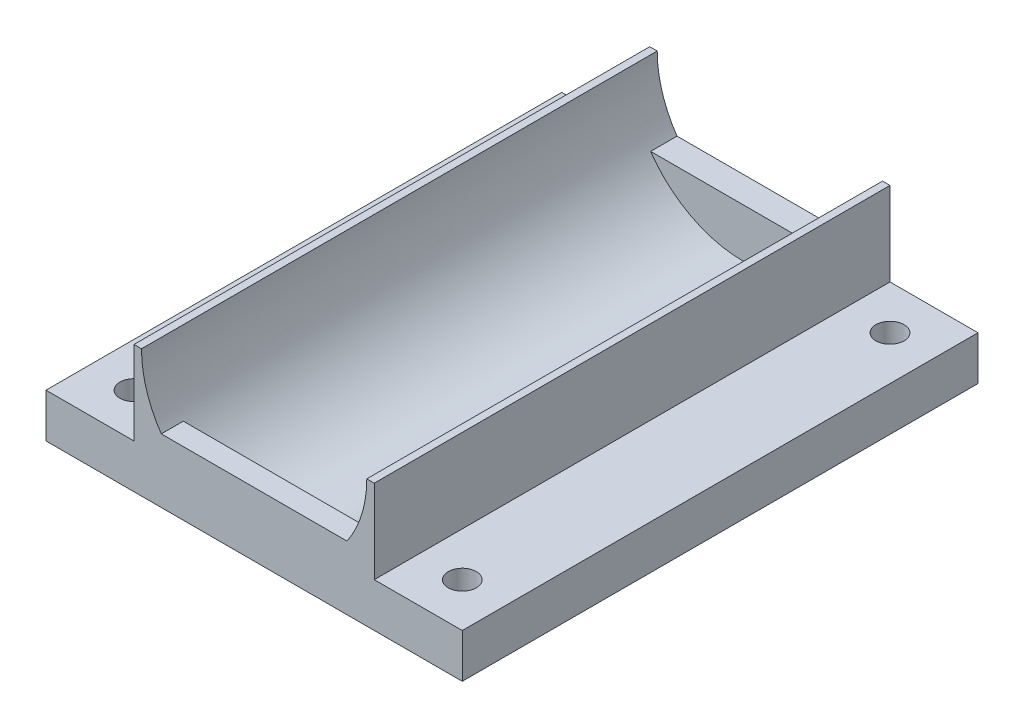
ISO-10303-21;
HEADER;
FILE_DESCRIPTION(('STEP AP214'),'2;1');
FILE_NAME('part.step','',(''),(''),'','','');
FILE_SCHEMA(('AUTOMOTIVE_DESIGN { 1 0 10303 214 1 1 1 1 }'));
ENDSEC;
DATA;
#1=APPLICATION_CONTEXT('core data for automotive mechanical design processes');
#2=APPLICATION_PROTOCOL_DEFINITION('international standard','automotive_design',2000,#1);
#3=PRODUCT_CONTEXT('',#1,'mechanical');
#4=PRODUCT('Part','Part','',(#3));
#5=PRODUCT_RELATED_PRODUCT_CATEGORY('part','',(#4));
#6=PRODUCT_DEFINITION_FORMATION('','',#4);
#7=PRODUCT_DEFINITION_CONTEXT('part definition',#1,'design');
#8=PRODUCT_DEFINITION('design','',#6,#7);
#9=PRODUCT_DEFINITION_SHAPE('','',#8);
#10=(LENGTH_UNIT() NAMED_UNIT(*) SI_UNIT(.MILLI.,.METRE.));
#11=(NAMED_UNIT(*) PLANE_ANGLE_UNIT() SI_UNIT($,.RADIAN.));
#12=(NAMED_UNIT(*) SI_UNIT($,.STERADIAN.) SOLID_ANGLE_UNIT());
#13=UNCERTAINTY_MEASURE_WITH_UNIT(LENGTH_MEASURE(1.E-05),#10,'distance_accuracy_value','');
#14=(GEOMETRIC_REPRESENTATION_CONTEXT(3) GLOBAL_UNCERTAINTY_ASSIGNED_CONTEXT((#13)) GLOBAL_UNIT_ASSIGNED_CONTEXT((#10,
#11,#12)) REPRESENTATION_CONTEXT('',''));
#15=CARTESIAN_POINT('',(0.,0.,0.));
#16=DIRECTION('',(0.,0.,1.));
#17=DIRECTION('',(1.,0.,0.));
#18=AXIS2_PLACEMENT_3D('',#15,#16,#17);
#19=CARTESIAN_POINT('',(0.,14.5,0.));
#20=DIRECTION('',(0.,1.,0.));
#21=DIRECTION('',(0.,0.,1.));
#22=AXIS2_PLACEMENT_3D('',#19,#20,#21);
#23=PLANE('',#22);
#24=DIRECTION('',(0.,0.,1.));
#25=VECTOR('',#24,1.);
#26=CARTESIAN_POINT('',(0.85,14.5,-58.6));
#27=LINE('',#26,#25);
#28=CARTESIAN_POINT('',(0.85,14.5,-58.6));
#29=VERTEX_POINT('',#28);
#30=CARTESIAN_POINT('',(0.85,14.5,0.));
#31=VERTEX_POINT('',#30);
#32=EDGE_CURVE('E244',#29,#31,#27,.T.);
#33=ORIENTED_EDGE('',*,*,#32,.F.);
#34=DIRECTION('',(1.,0.,0.));
#35=VECTOR('',#34,1.);
#36=CARTESIAN_POINT('',(0.,14.5,-58.6));
#37=LINE('',#36,#35);
#38=CARTESIAN_POINT('',(0.,14.5,-58.6));
#39=VERTEX_POINT('',#38);
#40=EDGE_CURVE('E215',#39,#29,#37,.T.);
#41=ORIENTED_EDGE('',*,*,#40,.F.);
#42=DIRECTION('',(0.,0.,-1.));
#43=VECTOR('',#42,1.);
#44=CARTESIAN_POINT('',(0.,14.5,0.));
#45=LINE('',#44,#43);
#46=CARTESIAN_POINT('',(0.,14.5,0.));
#47=VERTEX_POINT('',#46);
#48=EDGE_CURVE('E218',#47,#39,#45,.T.);
#49=ORIENTED_EDGE('',*,*,#48,.F.);
#50=DIRECTION('',(1.,0.,0.));
#51=VECTOR('',#50,1.);
#52=CARTESIAN_POINT('',(0.,14.5,0.));
#53=LINE('',#52,#51);
#54=EDGE_CURVE('E223',#47,#31,#53,.T.);
#55=ORIENTED_EDGE('',*,*,#54,.T.);
#56=EDGE_LOOP('',(#33,#41,#49,#55));
#57=FACE_BOUND('',#56,.T.);
#58=ADVANCED_FACE('F34',(#57),#23,.T.);
#59=CARTESIAN_POINT('',(0.,14.5,-58.6));
#60=DIRECTION('',(0.,0.,-1.));
#61=DIRECTION('',(-1.,0.,0.));
#62=AXIS2_PLACEMENT_3D('',#59,#60,#61);
#63=PLANE('',#62);
#64=DIRECTION('',(0.,-1.,0.));
#65=VECTOR('',#64,1.);
#66=CARTESIAN_POINT('',(27.3,14.5,-58.6));
#67=LINE('',#66,#65);
#68=CARTESIAN_POINT('',(27.3,14.5,-58.6));
#69=VERTEX_POINT('',#68);
#70=CARTESIAN_POINT('',(27.3,5.,-58.6));
#71=VERTEX_POINT('',#70);
#72=EDGE_CURVE('E229',#69,#71,#67,.T.);
#73=ORIENTED_EDGE('',*,*,#72,.T.);
#74=DIRECTION('',(-1.,0.,0.));
#75=VECTOR('',#74,1.);
#76=CARTESIAN_POINT('',(0.,5.,-58.6));
#77=LINE('',#76,#75);
#78=CARTESIAN_POINT('',(37.3,5.,-58.6));
#79=VERTEX_POINT('',#78);
#80=EDGE_CURVE('E57',#79,#71,#77,.T.);
#81=ORIENTED_EDGE('',*,*,#80,.F.);
#82=DIRECTION('',(0.,-1.,0.));
#83=VECTOR('',#82,1.);
#84=CARTESIAN_POINT('',(37.3,5.,-58.6));
#85=LINE('',#84,#83);
#86=CARTESIAN_POINT('',(37.3,0.,-58.6));
#87=VERTEX_POINT('',#86);
#88=EDGE_CURVE('E194',#79,#87,#85,.T.);
#89=ORIENTED_EDGE('',*,*,#88,.T.);
#90=DIRECTION('',(1.,0.,0.));
#91=VECTOR('',#90,1.);
#92=CARTESIAN_POINT('',(0.,0.,-58.6));
#93=LINE('',#92,#91);
#94=CARTESIAN_POINT('',(-9.99999999999999,0.,-58.6));
#95=VERTEX_POINT('',#94);
#96=EDGE_CURVE('E210',#95,#87,#93,.T.);
#97=ORIENTED_EDGE('',*,*,#96,.F.);
#98=DIRECTION('',(0.,-1.,0.));
#99=VECTOR('',#98,1.);
#100=CARTESIAN_POINT('',(-9.99999999999999,5.,-58.6));
#101=LINE('',#100,#99);
#102=CARTESIAN_POINT('',(-9.99999999999999,5.,-58.6));
#103=VERTEX_POINT('',#102);
#104=EDGE_CURVE('E163',#103,#95,#101,.T.);
#105=ORIENTED_EDGE('',*,*,#104,.F.);
#106=DIRECTION('',(1.,0.,0.));
#107=VECTOR('',#106,1.);
#108=CARTESIAN_POINT('',(0.,5.,-58.6));
#109=LINE('',#108,#107);
#110=CARTESIAN_POINT('',(0.,5.,-58.6));
#111=VERTEX_POINT('',#110);
#112=EDGE_CURVE('E154',#103,#111,#109,.T.);
#113=ORIENTED_EDGE('',*,*,#112,.T.);
#114=DIRECTION('',(0.,-1.,0.));
#115=VECTOR('',#114,1.);
#116=CARTESIAN_POINT('',(0.,14.5,-58.6));
#117=LINE('',#116,#115);
#118=EDGE_CURVE('E239',#39,#111,#117,.T.);
#119=ORIENTED_EDGE('',*,*,#118,.F.);
#120=ORIENTED_EDGE('',*,*,#40,.T.);
#121=CARTESIAN_POINT('',(13.65,14.5,-58.6));
#122=DIRECTION('',(0.,0.,1.));
#123=DIRECTION('',(1.,0.,0.));
#124=AXIS2_PLACEMENT_3D('',#121,#122,#123);
#125=CIRCLE('',#124,12.8);
#126=CARTESIAN_POINT('',(3.10118490066301,7.25,-58.6));
#127=VERTEX_POINT('',#126);
#128=EDGE_CURVE('E207',#29,#127,#125,.T.);
#129=ORIENTED_EDGE('',*,*,#128,.T.);
#130=DIRECTION('',(1.,0.,0.));
#131=VECTOR('',#130,1.);
#132=CARTESIAN_POINT('',(27.3,7.25,-58.6));
#133=LINE('',#132,#131);
#134=CARTESIAN_POINT('',(24.198815099337,7.25,-58.6));
#135=VERTEX_POINT('',#134);
#136=EDGE_CURVE('E200',#127,#135,#133,.T.);
#137=ORIENTED_EDGE('',*,*,#136,.T.);
#138=CARTESIAN_POINT('',(26.45,14.5,-58.6));
#139=VERTEX_POINT('',#138);
#140=EDGE_CURVE('E211',#135,#139,#125,.T.);
#141=ORIENTED_EDGE('',*,*,#140,.T.);
#142=EDGE_CURVE('E219',#139,#69,#37,.T.);
#143=ORIENTED_EDGE('',*,*,#142,.T.);
#144=EDGE_LOOP('',(#73,#81,#89,#97,#105,#113,#119,#120,#129,#137,#141,#143));
#145=FACE_BOUND('',#144,.T.);
#146=ADVANCED_FACE('F36',(#145),#63,.T.);
#147=CARTESIAN_POINT('',(0.,14.5,0.));
#148=DIRECTION('',(-1.,0.,0.));
#149=DIRECTION('',(0.,0.,1.));
#150=AXIS2_PLACEMENT_3D('',#147,#148,#149);
#151=PLANE('',#150);
#152=DIRECTION('',(0.,0.,-1.));
#153=VECTOR('',#152,1.);
#154=CARTESIAN_POINT('',(0.,5.,0.));
#155=LINE('',#154,#153);
#156=CARTESIAN_POINT('',(0.,5.,0.));
#157=VERTEX_POINT('',#156);
#158=EDGE_CURVE('E49',#157,#111,#155,.T.);
#159=ORIENTED_EDGE('',*,*,#158,.F.);
#160=DIRECTION('',(0.,-1.,0.));
#161=VECTOR('',#160,1.);
#162=CARTESIAN_POINT('',(0.,14.5,0.));
#163=LINE('',#162,#161);
#164=EDGE_CURVE('E145',#47,#157,#163,.T.);
#165=ORIENTED_EDGE('',*,*,#164,.F.);
#166=ORIENTED_EDGE('',*,*,#48,.T.);
#167=ORIENTED_EDGE('',*,*,#118,.T.);
#168=EDGE_LOOP('',(#159,#165,#166,#167));
#169=FACE_BOUND('',#168,.T.);
#170=ADVANCED_FACE('F285',(#169),#151,.T.);
#171=CARTESIAN_POINT('',(0.,14.5,0.));
#172=DIRECTION('',(0.,0.,-1.));
#173=DIRECTION('',(-1.,0.,0.));
#174=AXIS2_PLACEMENT_3D('',#171,#172,#173);
#175=PLANE('',#174);
#176=CARTESIAN_POINT('',(13.65,14.5,0.));
#177=DIRECTION('',(0.,0.,1.));
#178=DIRECTION('',(1.,0.,0.));
#179=AXIS2_PLACEMENT_3D('',#176,#177,#178);
#180=CIRCLE('',#179,12.8);
#181=CARTESIAN_POINT('',(24.198815099337,7.25,0.));
#182=VERTEX_POINT('',#181);
#183=CARTESIAN_POINT('',(26.45,14.5,0.));
#184=VERTEX_POINT('',#183);
#185=EDGE_CURVE('E205',#182,#184,#180,.T.);
#186=ORIENTED_EDGE('',*,*,#185,.F.);
#187=DIRECTION('',(1.,0.,0.));
#188=VECTOR('',#187,1.);
#189=CARTESIAN_POINT('',(27.3,7.25,0.));
#190=LINE('',#189,#188);
#191=CARTESIAN_POINT('',(3.10118490066301,7.25,0.));
#192=VERTEX_POINT('',#191);
#193=EDGE_CURVE('E198',#192,#182,#190,.T.);
#194=ORIENTED_EDGE('',*,*,#193,.F.);
#195=EDGE_CURVE('E212',#31,#192,#180,.T.);
#196=ORIENTED_EDGE('',*,*,#195,.F.);
#197=ORIENTED_EDGE('',*,*,#54,.F.);
#198=ORIENTED_EDGE('',*,*,#164,.T.);
#199=DIRECTION('',(1.,0.,0.));
#200=VECTOR('',#199,1.);
#201=CARTESIAN_POINT('',(0.,5.,0.));
#202=LINE('',#201,#200);
#203=CARTESIAN_POINT('',(-9.99999999999999,5.,0.));
#204=VERTEX_POINT('',#203);
#205=EDGE_CURVE('E137',#204,#157,#202,.T.);
#206=ORIENTED_EDGE('',*,*,#205,.F.);
#207=DIRECTION('',(0.,-1.,0.));
#208=VECTOR('',#207,1.);
#209=CARTESIAN_POINT('',(-9.99999999999999,5.,0.));
#210=LINE('',#209,#208);
#211=CARTESIAN_POINT('',(-9.99999999999999,0.,0.));
#212=VERTEX_POINT('',#211);
#213=EDGE_CURVE('E142',#204,#212,#210,.T.);
#214=ORIENTED_EDGE('',*,*,#213,.T.);
#215=DIRECTION('',(1.,0.,0.));
#216=VECTOR('',#215,1.);
#217=CARTESIAN_POINT('',(0.,0.,0.));
#218=LINE('',#217,#216);
#219=CARTESIAN_POINT('',(37.3,0.,0.));
#220=VERTEX_POINT('',#219);
#221=EDGE_CURVE('E231',#212,#220,#218,.T.);
#222=ORIENTED_EDGE('',*,*,#221,.T.);
#223=DIRECTION('',(0.,-1.,0.));
#224=VECTOR('',#223,1.);
#225=CARTESIAN_POINT('',(37.3,5.,0.));
#226=LINE('',#225,#224);
#227=CARTESIAN_POINT('',(37.3,5.,0.));
#228=VERTEX_POINT('',#227);
#229=EDGE_CURVE('E186',#228,#220,#226,.T.);
#230=ORIENTED_EDGE('',*,*,#229,.F.);
#231=DIRECTION('',(1.,0.,0.));
#232=VECTOR('',#231,1.);
#233=CARTESIAN_POINT('',(0.,5.,0.));
#234=LINE('',#233,#232);
#235=CARTESIAN_POINT('',(27.3,5.,0.));
#236=VERTEX_POINT('',#235);
#237=EDGE_CURVE('E179',#236,#228,#234,.T.);
#238=ORIENTED_EDGE('',*,*,#237,.F.);
#239=DIRECTION('',(0.,-1.,0.));
#240=VECTOR('',#239,1.);
#241=CARTESIAN_POINT('',(27.3,14.5,0.));
#242=LINE('',#241,#240);
#243=CARTESIAN_POINT('',(27.3,14.5,0.));
#244=VERTEX_POINT('',#243);
#245=EDGE_CURVE('E235',#244,#236,#242,.T.);
#246=ORIENTED_EDGE('',*,*,#245,.F.);
#247=EDGE_CURVE('E222',#184,#244,#53,.T.);
#248=ORIENTED_EDGE('',*,*,#247,.F.);
#249=EDGE_LOOP('',(#186,#194,#196,#197,#198,#206,#214,#222,#230,#238,#246,#248));
#250=FACE_BOUND('',#249,.T.);
#251=ADVANCED_FACE('F140',(#250),#175,.F.);
#252=CARTESIAN_POINT('',(27.3,14.5,0.));
#253=DIRECTION('',(-1.,0.,0.));
#254=DIRECTION('',(0.,0.,1.));
#255=AXIS2_PLACEMENT_3D('',#252,#253,#254);
#256=PLANE('',#255);
#257=ORIENTED_EDGE('',*,*,#245,.T.);
#258=DIRECTION('',(0.,0.,-1.));
#259=VECTOR('',#258,1.);
#260=CARTESIAN_POINT('',(27.3,5.,0.));
#261=LINE('',#260,#259);
#262=EDGE_CURVE('E177',#236,#71,#261,.T.);
#263=ORIENTED_EDGE('',*,*,#262,.T.);
#264=ORIENTED_EDGE('',*,*,#72,.F.);
#265=DIRECTION('',(0.,0.,-1.));
#266=VECTOR('',#265,1.);
#267=CARTESIAN_POINT('',(27.3,14.5,0.));
#268=LINE('',#267,#266);
#269=EDGE_CURVE('E226',#244,#69,#268,.T.);
#270=ORIENTED_EDGE('',*,*,#269,.F.);
#271=EDGE_LOOP('',(#257,#263,#264,#270));
#272=FACE_BOUND('',#271,.T.);
#273=ADVANCED_FACE('F311',(#272),#256,.F.);
#274=DIRECTION('',(0.,0.,1.));
#275=VECTOR('',#274,1.);
#276=CARTESIAN_POINT('',(26.45,14.5,-58.6));
#277=LINE('',#276,#275);
#278=EDGE_CURVE('E241',#184,#139,#277,.F.);
#279=ORIENTED_EDGE('',*,*,#278,.F.);
#280=ORIENTED_EDGE('',*,*,#247,.T.);
#281=ORIENTED_EDGE('',*,*,#269,.T.);
#282=ORIENTED_EDGE('',*,*,#142,.F.);
#283=EDGE_LOOP('',(#279,#280,#281,#282));
#284=FACE_BOUND('',#283,.T.);
#285=ADVANCED_FACE('F269',(#284),#23,.T.);
#286=CARTESIAN_POINT('',(0.,0.,0.));
#287=DIRECTION('',(0.,1.,0.));
#288=DIRECTION('',(0.,0.,1.));
#289=AXIS2_PLACEMENT_3D('',#286,#287,#288);
#290=PLANE('',#289);
#291=ORIENTED_EDGE('',*,*,#96,.T.);
#292=DIRECTION('',(0.,0.,1.));
#293=VECTOR('',#292,1.);
#294=CARTESIAN_POINT('',(37.3,0.,0.));
#295=LINE('',#294,#293);
#296=EDGE_CURVE('E162',#87,#220,#295,.T.);
#297=ORIENTED_EDGE('',*,*,#296,.T.);
#298=ORIENTED_EDGE('',*,*,#221,.F.);
#299=DIRECTION('',(0.,0.,1.));
#300=VECTOR('',#299,1.);
#301=CARTESIAN_POINT('',(-9.99999999999999,0.,0.));
#302=LINE('',#301,#300);
#303=EDGE_CURVE('E161',#95,#212,#302,.T.);
#304=ORIENTED_EDGE('',*,*,#303,.F.);
#305=EDGE_LOOP('',(#291,#297,#298,#304));
#306=FACE_BOUND('',#305,.T.);
#307=CARTESIAN_POINT('',(32.3,0.,-53.6));
#308=DIRECTION('',(0.,1.,0.));
#309=DIRECTION('',(0.,0.,1.));
#310=AXIS2_PLACEMENT_3D('',#307,#308,#309);
#311=CIRCLE('',#310,1.6);
#312=CARTESIAN_POINT('',(32.3,0.,-52.));
#313=VERTEX_POINT('',#312);
#314=EDGE_CURVE('E166',#313,#313,#311,.T.);
#315=ORIENTED_EDGE('',*,*,#314,.T.);
#316=EDGE_LOOP('',(#315));
#317=FACE_BOUND('',#316,.T.);
#318=CARTESIAN_POINT('',(32.3,0.,-5.));
#319=DIRECTION('',(0.,1.,0.));
#320=DIRECTION('',(0.,0.,1.));
#321=AXIS2_PLACEMENT_3D('',#318,#319,#320);
#322=CIRCLE('',#321,1.6);
#323=CARTESIAN_POINT('',(32.3,0.,-3.4));
#324=VERTEX_POINT('',#323);
#325=EDGE_CURVE('E175',#324,#324,#322,.F.);
#326=ORIENTED_EDGE('',*,*,#325,.F.);
#327=EDGE_LOOP('',(#326));
#328=FACE_BOUND('',#327,.T.);
#329=CARTESIAN_POINT('',(-4.99999999999999,0.,-4.99999999999999));
#330=DIRECTION('',(0.,1.,0.));
#331=DIRECTION('',(0.,0.,1.));
#332=AXIS2_PLACEMENT_3D('',#329,#330,#331);
#333=CIRCLE('',#332,1.6);
#334=CARTESIAN_POINT('',(-4.99999999999999,0.,-3.39999999999999));
#335=VERTEX_POINT('',#334);
#336=EDGE_CURVE('E295',#335,#335,#333,.T.);
#337=ORIENTED_EDGE('',*,*,#336,.T.);
#338=EDGE_LOOP('',(#337));
#339=FACE_BOUND('',#338,.T.);
#340=CARTESIAN_POINT('',(-4.99999999999999,0.,-53.6));
#341=DIRECTION('',(0.,1.,0.));
#342=DIRECTION('',(0.,0.,1.));
#343=AXIS2_PLACEMENT_3D('',#340,#341,#342);
#344=CIRCLE('',#343,1.6);
#345=CARTESIAN_POINT('',(-4.99999999999999,0.,-52.));
#346=VERTEX_POINT('',#345);
#347=EDGE_CURVE('E157',#346,#346,#344,.F.);
#348=ORIENTED_EDGE('',*,*,#347,.F.);
#349=EDGE_LOOP('',(#348));
#350=FACE_BOUND('',#349,.T.);
#351=ADVANCED_FACE('F302',(#306,#317,#328,#339,#350),#290,.F.);
#352=CARTESIAN_POINT('',(13.65,14.5,-58.6));
#353=DIRECTION('',(0.,0.,1.));
#354=DIRECTION('',(1.,0.,0.));
#355=AXIS2_PLACEMENT_3D('',#352,#353,#354);
#356=CYLINDRICAL_SURFACE('',#355,12.8);
#357=ORIENTED_EDGE('',*,*,#195,.T.);
#358=DIRECTION('',(0.,0.,1.));
#359=VECTOR('',#358,1.);
#360=CARTESIAN_POINT('',(3.10118490066301,7.25,-58.6));
#361=LINE('',#360,#359);
#362=CARTESIAN_POINT('',(3.10118490066301,7.25,-2.5));
#363=VERTEX_POINT('',#362);
#364=EDGE_CURVE('E11',#192,#363,#361,.F.);
#365=ORIENTED_EDGE('',*,*,#364,.T.);
#366=CARTESIAN_POINT('',(13.65,14.5,-2.5));
#367=DIRECTION('',(0.,0.,-1.));
#368=DIRECTION('',(-1.,0.,0.));
#369=AXIS2_PLACEMENT_3D('',#366,#367,#368);
#370=CIRCLE('',#369,12.8);
#371=CARTESIAN_POINT('',(24.198815099337,7.25,-2.5));
#372=VERTEX_POINT('',#371);
#373=EDGE_CURVE('E254',#363,#372,#370,.F.);
#374=ORIENTED_EDGE('',*,*,#373,.T.);
#375=DIRECTION('',(0.,0.,1.));
#376=VECTOR('',#375,1.);
#377=CARTESIAN_POINT('',(24.198815099337,7.25,-58.6));
#378=LINE('',#377,#376);
#379=EDGE_CURVE('E42',#372,#182,#378,.T.);
#380=ORIENTED_EDGE('',*,*,#379,.T.);
#381=ORIENTED_EDGE('',*,*,#185,.T.);
#382=ORIENTED_EDGE('',*,*,#278,.T.);
#383=ORIENTED_EDGE('',*,*,#140,.F.);
#384=DIRECTION('',(0.,0.,1.));
#385=VECTOR('',#384,1.);
#386=CARTESIAN_POINT('',(24.198815099337,7.25,-58.6));
#387=LINE('',#386,#385);
#388=CARTESIAN_POINT('',(24.198815099337,7.25,-55.6));
#389=VERTEX_POINT('',#388);
#390=EDGE_CURVE('E248',#135,#389,#387,.T.);
#391=ORIENTED_EDGE('',*,*,#390,.T.);
#392=CARTESIAN_POINT('',(13.65,14.5,-55.6));
#393=DIRECTION('',(0.,0.,-1.));
#394=DIRECTION('',(-1.,0.,0.));
#395=AXIS2_PLACEMENT_3D('',#392,#393,#394);
#396=CIRCLE('',#395,12.8);
#397=CARTESIAN_POINT('',(3.10118490066301,7.25,-55.6));
#398=VERTEX_POINT('',#397);
#399=EDGE_CURVE('E246',#398,#389,#396,.F.);
#400=ORIENTED_EDGE('',*,*,#399,.F.);
#401=DIRECTION('',(0.,0.,1.));
#402=VECTOR('',#401,1.);
#403=CARTESIAN_POINT('',(3.10118490066301,7.25,-58.6));
#404=LINE('',#403,#402);
#405=EDGE_CURVE('E251',#398,#127,#404,.F.);
#406=ORIENTED_EDGE('',*,*,#405,.T.);
#407=ORIENTED_EDGE('',*,*,#128,.F.);
#408=ORIENTED_EDGE('',*,*,#32,.T.);
#409=EDGE_LOOP('',(#357,#365,#374,#380,#381,#382,#383,#391,#400,#406,#407,#408));
#410=FACE_BOUND('',#409,.T.);
#411=ADVANCED_FACE('F259',(#410),#356,.F.);
#412=CARTESIAN_POINT('',(27.3,7.25,-55.6));
#413=DIRECTION('',(0.,1.,0.));
#414=DIRECTION('',(0.,0.,1.));
#415=AXIS2_PLACEMENT_3D('',#412,#413,#414);
#416=PLANE('',#415);
#417=ORIENTED_EDGE('',*,*,#405,.F.);
#418=DIRECTION('',(1.,0.,0.));
#419=VECTOR('',#418,1.);
#420=CARTESIAN_POINT('',(27.3,7.25,-55.6));
#421=LINE('',#420,#419);
#422=EDGE_CURVE('E202',#398,#389,#421,.T.);
#423=ORIENTED_EDGE('',*,*,#422,.T.);
#424=ORIENTED_EDGE('',*,*,#390,.F.);
#425=ORIENTED_EDGE('',*,*,#136,.F.);
#426=EDGE_LOOP('',(#417,#423,#424,#425));
#427=FACE_BOUND('',#426,.T.);
#428=ADVANCED_FACE('F277',(#427),#416,.T.);
#429=CARTESIAN_POINT('',(0.,0.,-55.6));
#430=DIRECTION('',(0.,0.,-1.));
#431=DIRECTION('',(-1.,0.,0.));
#432=AXIS2_PLACEMENT_3D('',#429,#430,#431);
#433=PLANE('',#432);
#434=ORIENTED_EDGE('',*,*,#422,.F.);
#435=ORIENTED_EDGE('',*,*,#399,.T.);
#436=EDGE_LOOP('',(#434,#435));
#437=FACE_BOUND('',#436,.T.);
#438=ADVANCED_FACE('F280',(#437),#433,.F.);
#439=CARTESIAN_POINT('',(27.3,7.25,0.));
#440=DIRECTION('',(0.,1.,0.));
#441=DIRECTION('',(0.,0.,1.));
#442=AXIS2_PLACEMENT_3D('',#439,#440,#441);
#443=PLANE('',#442);
#444=ORIENTED_EDGE('',*,*,#364,.F.);
#445=ORIENTED_EDGE('',*,*,#193,.T.);
#446=ORIENTED_EDGE('',*,*,#379,.F.);
#447=DIRECTION('',(1.,0.,0.));
#448=VECTOR('',#447,1.);
#449=CARTESIAN_POINT('',(27.3,7.25,-2.5));
#450=LINE('',#449,#448);
#451=EDGE_CURVE('E197',#363,#372,#450,.T.);
#452=ORIENTED_EDGE('',*,*,#451,.F.);
#453=EDGE_LOOP('',(#444,#445,#446,#452));
#454=FACE_BOUND('',#453,.T.);
#455=ADVANCED_FACE('F324',(#454),#443,.T.);
#456=CARTESIAN_POINT('',(0.,0.,-2.5));
#457=DIRECTION('',(0.,0.,-1.));
#458=DIRECTION('',(-1.,0.,0.));
#459=AXIS2_PLACEMENT_3D('',#456,#457,#458);
#460=PLANE('',#459);
#461=ORIENTED_EDGE('',*,*,#373,.F.);
#462=ORIENTED_EDGE('',*,*,#451,.T.);
#463=EDGE_LOOP('',(#461,#462));
#464=FACE_BOUND('',#463,.T.);
#465=ADVANCED_FACE('F327',(#464),#460,.T.);
#466=CARTESIAN_POINT('',(37.3,5.,0.));
#467=DIRECTION('',(1.,0.,0.));
#468=DIRECTION('',(0.,0.,-1.));
#469=AXIS2_PLACEMENT_3D('',#466,#467,#468);
#470=PLANE('',#469);
#471=ORIENTED_EDGE('',*,*,#296,.F.);
#472=ORIENTED_EDGE('',*,*,#88,.F.);
#473=DIRECTION('',(0.,0.,1.));
#474=VECTOR('',#473,1.);
#475=CARTESIAN_POINT('',(37.3,5.,0.));
#476=LINE('',#475,#474);
#477=EDGE_CURVE('E172',#79,#228,#476,.T.);
#478=ORIENTED_EDGE('',*,*,#477,.T.);
#479=ORIENTED_EDGE('',*,*,#229,.T.);
#480=EDGE_LOOP('',(#471,#472,#478,#479));
#481=FACE_BOUND('',#480,.T.);
#482=ADVANCED_FACE('F330',(#481),#470,.T.);
#483=CARTESIAN_POINT('',(32.3,5.,-53.6));
#484=DIRECTION('',(0.,-1.,0.));
#485=DIRECTION('',(0.,0.,-1.));
#486=AXIS2_PLACEMENT_3D('',#483,#484,#485);
#487=CYLINDRICAL_SURFACE('',#486,1.6);
#488=CARTESIAN_POINT('',(32.3,5.,-53.6));
#489=DIRECTION('',(0.,1.,0.));
#490=DIRECTION('',(0.,0.,1.));
#491=AXIS2_PLACEMENT_3D('',#488,#489,#490);
#492=CIRCLE('',#491,1.6);
#493=CARTESIAN_POINT('',(32.3,5.,-52.));
#494=VERTEX_POINT('',#493);
#495=EDGE_CURVE('E181',#494,#494,#492,.T.);
#496=ORIENTED_EDGE('',*,*,#495,.T.);
#497=EDGE_LOOP('',(#496));
#498=FACE_BOUND('',#497,.T.);
#499=ORIENTED_EDGE('',*,*,#314,.F.);
#500=EDGE_LOOP('',(#499));
#501=FACE_BOUND('',#500,.T.);
#502=ADVANCED_FACE('F334',(#498,#501),#487,.F.);
#503=CARTESIAN_POINT('',(32.3,5.,-5.));
#504=DIRECTION('',(0.,-1.,0.));
#505=DIRECTION('',(0.,0.,-1.));
#506=AXIS2_PLACEMENT_3D('',#503,#504,#505);
#507=CYLINDRICAL_SURFACE('',#506,1.6);
#508=CARTESIAN_POINT('',(32.3,5.,-5.));
#509=DIRECTION('',(0.,1.,0.));
#510=DIRECTION('',(0.,0.,1.));
#511=AXIS2_PLACEMENT_3D('',#508,#509,#510);
#512=CIRCLE('',#511,1.6);
#513=CARTESIAN_POINT('',(32.3,5.,-3.4));
#514=VERTEX_POINT('',#513);
#515=EDGE_CURVE('E184',#514,#514,#512,.F.);
#516=ORIENTED_EDGE('',*,*,#515,.F.);
#517=EDGE_LOOP('',(#516));
#518=FACE_BOUND('',#517,.T.);
#519=ORIENTED_EDGE('',*,*,#325,.T.);
#520=EDGE_LOOP('',(#519));
#521=FACE_BOUND('',#520,.T.);
#522=ADVANCED_FACE('F338',(#518,#521),#507,.F.);
#523=CARTESIAN_POINT('',(0.,5.,0.));
#524=DIRECTION('',(0.,1.,0.));
#525=DIRECTION('',(0.,0.,1.));
#526=AXIS2_PLACEMENT_3D('',#523,#524,#525);
#527=PLANE('',#526);
#528=ORIENTED_EDGE('',*,*,#477,.F.);
#529=ORIENTED_EDGE('',*,*,#80,.T.);
#530=ORIENTED_EDGE('',*,*,#262,.F.);
#531=ORIENTED_EDGE('',*,*,#237,.T.);
#532=EDGE_LOOP('',(#528,#529,#530,#531));
#533=FACE_BOUND('',#532,.T.);
#534=ORIENTED_EDGE('',*,*,#495,.F.);
#535=EDGE_LOOP('',(#534));
#536=FACE_BOUND('',#535,.T.);
#537=ORIENTED_EDGE('',*,*,#515,.T.);
#538=EDGE_LOOP('',(#537));
#539=FACE_BOUND('',#538,.T.);
#540=ADVANCED_FACE('F342',(#533,#536,#539),#527,.T.);
#541=CARTESIAN_POINT('',(-9.99999999999999,5.,0.));
#542=DIRECTION('',(1.,0.,0.));
#543=DIRECTION('',(0.,0.,-1.));
#544=AXIS2_PLACEMENT_3D('',#541,#542,#543);
#545=PLANE('',#544);
#546=ORIENTED_EDGE('',*,*,#303,.T.);
#547=ORIENTED_EDGE('',*,*,#213,.F.);
#548=DIRECTION('',(0.,0.,1.));
#549=VECTOR('',#548,1.);
#550=CARTESIAN_POINT('',(-9.99999999999999,5.,0.));
#551=LINE('',#550,#549);
#552=EDGE_CURVE('E147',#103,#204,#551,.T.);
#553=ORIENTED_EDGE('',*,*,#552,.F.);
#554=ORIENTED_EDGE('',*,*,#104,.T.);
#555=EDGE_LOOP('',(#546,#547,#553,#554));
#556=FACE_BOUND('',#555,.T.);
#557=ADVANCED_FACE('F159',(#556),#545,.F.);
#558=CARTESIAN_POINT('',(-4.99999999999999,5.,-4.99999999999999));
#559=DIRECTION('',(0.,-1.,0.));
#560=DIRECTION('',(0.,0.,-1.));
#561=AXIS2_PLACEMENT_3D('',#558,#559,#560);
#562=CYLINDRICAL_SURFACE('',#561,1.6);
#563=CARTESIAN_POINT('',(-4.99999999999999,5.,-4.99999999999999));
#564=DIRECTION('',(0.,1.,0.));
#565=DIRECTION('',(0.,0.,1.));
#566=AXIS2_PLACEMENT_3D('',#563,#564,#565);
#567=CIRCLE('',#566,1.6);
#568=CARTESIAN_POINT('',(-4.99999999999999,5.,-3.39999999999999));
#569=VERTEX_POINT('',#568);
#570=EDGE_CURVE('E287',#569,#569,#567,.T.);
#571=ORIENTED_EDGE('',*,*,#570,.T.);
#572=EDGE_LOOP('',(#571));
#573=FACE_BOUND('',#572,.T.);
#574=ORIENTED_EDGE('',*,*,#336,.F.);
#575=EDGE_LOOP('',(#574));
#576=FACE_BOUND('',#575,.T.);
#577=ADVANCED_FACE('F348',(#573,#576),#562,.F.);
#578=CARTESIAN_POINT('',(-4.99999999999999,5.,-53.6));
#579=DIRECTION('',(0.,-1.,0.));
#580=DIRECTION('',(0.,0.,-1.));
#581=AXIS2_PLACEMENT_3D('',#578,#579,#580);
#582=CYLINDRICAL_SURFACE('',#581,1.6);
#583=CARTESIAN_POINT('',(-4.99999999999999,5.,-53.6));
#584=DIRECTION('',(0.,1.,0.));
#585=DIRECTION('',(0.,0.,1.));
#586=AXIS2_PLACEMENT_3D('',#583,#584,#585);
#587=CIRCLE('',#586,1.6);
#588=CARTESIAN_POINT('',(-4.99999999999999,5.,-52.));
#589=VERTEX_POINT('',#588);
#590=EDGE_CURVE('E168',#589,#589,#587,.F.);
#591=ORIENTED_EDGE('',*,*,#590,.F.);
#592=EDGE_LOOP('',(#591));
#593=FACE_BOUND('',#592,.T.);
#594=ORIENTED_EDGE('',*,*,#347,.T.);
#595=EDGE_LOOP('',(#594));
#596=FACE_BOUND('',#595,.T.);
#597=ADVANCED_FACE('F300',(#593,#596),#582,.F.);
#598=CARTESIAN_POINT('',(0.,5.,0.));
#599=DIRECTION('',(0.,1.,0.));
#600=DIRECTION('',(0.,0.,1.));
#601=AXIS2_PLACEMENT_3D('',#598,#599,#600);
#602=PLANE('',#601);
#603=ORIENTED_EDGE('',*,*,#552,.T.);
#604=ORIENTED_EDGE('',*,*,#205,.T.);
#605=ORIENTED_EDGE('',*,*,#158,.T.);
#606=ORIENTED_EDGE('',*,*,#112,.F.);
#607=EDGE_LOOP('',(#603,#604,#605,#606));
#608=FACE_BOUND('',#607,.T.);
#609=ORIENTED_EDGE('',*,*,#570,.F.);
#610=EDGE_LOOP('',(#609));
#611=FACE_BOUND('',#610,.T.);
#612=ORIENTED_EDGE('',*,*,#590,.T.);
#613=EDGE_LOOP('',(#612));
#614=FACE_BOUND('',#613,.T.);
#615=ADVANCED_FACE('F151',(#608,#611,#614),#602,.T.);
#616=CLOSED_SHELL('',(#58,#146,#170,#251,#273,#285,#351,#411,#428,#438,#455,#465,#482,#502,#522,
#540,#557,#577,#597,#615));
#617=MANIFOLD_SOLID_BREP('B2',#616);
#618=ADVANCED_BREP_SHAPE_REPRESENTATION('',(#18,#617),#14);
#619=SHAPE_DEFINITION_REPRESENTATION(#9,#618);
ENDSEC;
END-ISO-10303-21;
